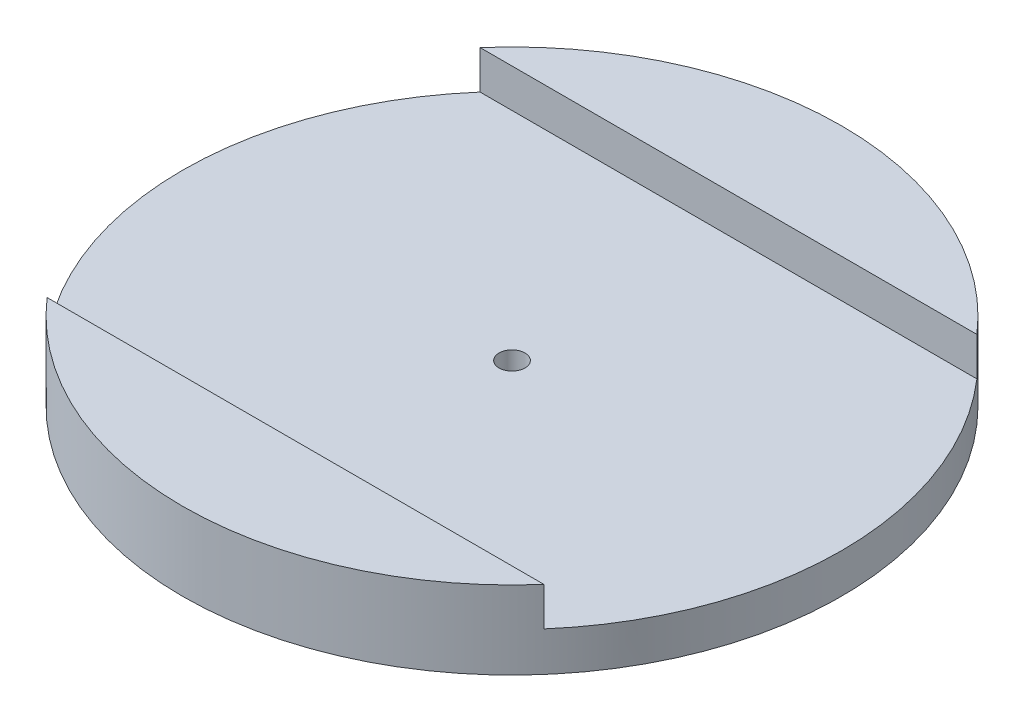
ISO-10303-21;
HEADER;
FILE_DESCRIPTION(('STEP AP214'),'2;1');
FILE_NAME('part.step','',(''),(''),'','','');
FILE_SCHEMA(('AUTOMOTIVE_DESIGN { 1 0 10303 214 1 1 1 1 }'));
ENDSEC;
DATA;
#1=APPLICATION_CONTEXT('core data for automotive mechanical design processes');
#2=APPLICATION_PROTOCOL_DEFINITION('international standard','automotive_design',2000,#1);
#3=PRODUCT_CONTEXT('',#1,'mechanical');
#4=PRODUCT('Part','Part','',(#3));
#5=PRODUCT_RELATED_PRODUCT_CATEGORY('part','',(#4));
#6=PRODUCT_DEFINITION_FORMATION('','',#4);
#7=PRODUCT_DEFINITION_CONTEXT('part definition',#1,'design');
#8=PRODUCT_DEFINITION('design','',#6,#7);
#9=PRODUCT_DEFINITION_SHAPE('','',#8);
#10=(LENGTH_UNIT() NAMED_UNIT(*) SI_UNIT(.MILLI.,.METRE.));
#11=(NAMED_UNIT(*) PLANE_ANGLE_UNIT() SI_UNIT($,.RADIAN.));
#12=(NAMED_UNIT(*) SI_UNIT($,.STERADIAN.) SOLID_ANGLE_UNIT());
#13=UNCERTAINTY_MEASURE_WITH_UNIT(LENGTH_MEASURE(1.E-05),#10,'distance_accuracy_value','');
#14=(GEOMETRIC_REPRESENTATION_CONTEXT(3) GLOBAL_UNCERTAINTY_ASSIGNED_CONTEXT((#13)) GLOBAL_UNIT_ASSIGNED_CONTEXT((#10,
#11,#12)) REPRESENTATION_CONTEXT('',''));
#15=CARTESIAN_POINT('',(0.,0.,0.));
#16=DIRECTION('',(0.,0.,1.));
#17=DIRECTION('',(1.,0.,0.));
#18=AXIS2_PLACEMENT_3D('',#15,#16,#17);
#19=CARTESIAN_POINT('',(0.,18.,0.));
#20=DIRECTION('',(0.,1.,0.));
#21=DIRECTION('',(0.,0.,1.));
#22=AXIS2_PLACEMENT_3D('',#19,#20,#21);
#23=PLANE('',#22);
#24=DIRECTION('',(-1.,0.,0.));
#25=VECTOR('',#24,1.);
#26=CARTESIAN_POINT('',(0.,18.,-49.9317963849467));
#27=LINE('',#26,#25);
#28=CARTESIAN_POINT('',(57.2958611923429,18.,-49.9317963849467));
#29=VERTEX_POINT('',#28);
#30=CARTESIAN_POINT('',(-57.2958611923429,18.,-49.9317963849467));
#31=VERTEX_POINT('',#30);
#32=EDGE_CURVE('E86',#29,#31,#27,.T.);
#33=ORIENTED_EDGE('',*,*,#32,.F.);
#34=CARTESIAN_POINT('',(0.,18.,0.));
#35=DIRECTION('',(0.,1.,0.));
#36=DIRECTION('',(0.,0.,1.));
#37=AXIS2_PLACEMENT_3D('',#34,#35,#36);
#38=CIRCLE('',#37,76.);
#39=EDGE_CURVE('E87',#29,#31,#38,.T.);
#40=ORIENTED_EDGE('',*,*,#39,.T.);
#41=EDGE_LOOP('',(#33,#40));
#42=FACE_BOUND('',#41,.T.);
#43=ADVANCED_FACE('F39',(#42),#23,.T.);
#44=CARTESIAN_POINT('',(0.,18.,0.));
#45=DIRECTION('',(0.,-1.,0.));
#46=DIRECTION('',(0.,0.,-1.));
#47=AXIS2_PLACEMENT_3D('',#44,#45,#46);
#48=CYLINDRICAL_SURFACE('',#47,76.);
#49=ORIENTED_EDGE('',*,*,#39,.F.);
#50=DIRECTION('',(0.,-1.,0.));
#51=VECTOR('',#50,1.);
#52=CARTESIAN_POINT('',(57.2958611923429,18.,-49.9317963849467));
#53=LINE('',#52,#51);
#54=CARTESIAN_POINT('',(57.2958611923429,9.11,-49.9317963849467));
#55=VERTEX_POINT('',#54);
#56=EDGE_CURVE('E102',#29,#55,#53,.T.);
#57=ORIENTED_EDGE('',*,*,#56,.T.);
#58=CARTESIAN_POINT('',(0.,9.11,0.));
#59=DIRECTION('',(0.,1.,0.));
#60=DIRECTION('',(0.,0.,1.));
#61=AXIS2_PLACEMENT_3D('',#58,#59,#60);
#62=CIRCLE('',#61,76.);
#63=CARTESIAN_POINT('',(57.2958611923429,9.11,49.9317963849467));
#64=VERTEX_POINT('',#63);
#65=EDGE_CURVE('E11',#64,#55,#62,.T.);
#66=ORIENTED_EDGE('',*,*,#65,.F.);
#67=DIRECTION('',(0.,-1.,0.));
#68=VECTOR('',#67,1.);
#69=CARTESIAN_POINT('',(57.2958611923429,18.,49.9317963849467));
#70=LINE('',#69,#68);
#71=CARTESIAN_POINT('',(57.2958611923429,18.,49.9317963849467));
#72=VERTEX_POINT('',#71);
#73=EDGE_CURVE('E81',#64,#72,#70,.F.);
#74=ORIENTED_EDGE('',*,*,#73,.T.);
#75=CARTESIAN_POINT('',(-57.2958611923429,18.,49.9317963849467));
#76=VERTEX_POINT('',#75);
#77=EDGE_CURVE('E93',#76,#72,#38,.T.);
#78=ORIENTED_EDGE('',*,*,#77,.F.);
#79=DIRECTION('',(0.,-1.,0.));
#80=VECTOR('',#79,1.);
#81=CARTESIAN_POINT('',(-57.2958611923429,18.,49.9317963849467));
#82=LINE('',#81,#80);
#83=CARTESIAN_POINT('',(-57.2958611923429,9.11,49.9317963849467));
#84=VERTEX_POINT('',#83);
#85=EDGE_CURVE('E54',#76,#84,#82,.T.);
#86=ORIENTED_EDGE('',*,*,#85,.T.);
#87=CARTESIAN_POINT('',(-57.2958611923429,9.11,-49.9317963849467));
#88=VERTEX_POINT('',#87);
#89=EDGE_CURVE('E43',#88,#84,#62,.T.);
#90=ORIENTED_EDGE('',*,*,#89,.F.);
#91=DIRECTION('',(0.,-1.,0.));
#92=VECTOR('',#91,1.);
#93=CARTESIAN_POINT('',(-57.2958611923429,18.,-49.9317963849467));
#94=LINE('',#93,#92);
#95=EDGE_CURVE('E62',#88,#31,#94,.F.);
#96=ORIENTED_EDGE('',*,*,#95,.T.);
#97=EDGE_LOOP('',(#49,#57,#66,#74,#78,#86,#90,#96));
#98=FACE_BOUND('',#97,.T.);
#99=CARTESIAN_POINT('',(0.,0.,0.));
#100=DIRECTION('',(0.,1.,0.));
#101=DIRECTION('',(0.,0.,1.));
#102=AXIS2_PLACEMENT_3D('',#99,#100,#101);
#103=CIRCLE('',#102,76.);
#104=CARTESIAN_POINT('',(0.,0.,76.));
#105=VERTEX_POINT('',#104);
#106=EDGE_CURVE('E98',#105,#105,#103,.T.);
#107=ORIENTED_EDGE('',*,*,#106,.T.);
#108=EDGE_LOOP('',(#107));
#109=FACE_BOUND('',#108,.T.);
#110=ADVANCED_FACE('F41',(#98,#109),#48,.T.);
#111=DIRECTION('',(1.,0.,0.));
#112=VECTOR('',#111,1.);
#113=CARTESIAN_POINT('',(0.,18.,49.9317963849467));
#114=LINE('',#113,#112);
#115=EDGE_CURVE('E78',#76,#72,#114,.T.);
#116=ORIENTED_EDGE('',*,*,#115,.F.);
#117=ORIENTED_EDGE('',*,*,#77,.T.);
#118=EDGE_LOOP('',(#116,#117));
#119=FACE_BOUND('',#118,.T.);
#120=ADVANCED_FACE('F97',(#119),#23,.T.);
#121=CARTESIAN_POINT('',(0.,0.,0.));
#122=DIRECTION('',(0.,1.,0.));
#123=DIRECTION('',(0.,0.,1.));
#124=AXIS2_PLACEMENT_3D('',#121,#122,#123);
#125=PLANE('',#124);
#126=CARTESIAN_POINT('',(0.,0.,0.));
#127=DIRECTION('',(0.,1.,0.));
#128=DIRECTION('',(0.,0.,1.));
#129=AXIS2_PLACEMENT_3D('',#126,#127,#128);
#130=CIRCLE('',#129,3.);
#131=CARTESIAN_POINT('',(0.,0.,3.));
#132=VERTEX_POINT('',#131);
#133=EDGE_CURVE('E111',#132,#132,#130,.T.);
#134=ORIENTED_EDGE('',*,*,#133,.T.);
#135=EDGE_LOOP('',(#134));
#136=FACE_BOUND('',#135,.T.);
#137=ORIENTED_EDGE('',*,*,#106,.F.);
#138=EDGE_LOOP('',(#137));
#139=FACE_BOUND('',#138,.T.);
#140=ADVANCED_FACE('F127',(#136,#139),#125,.F.);
#141=CARTESIAN_POINT('',(-58.0079555223723,9.11,0.));
#142=DIRECTION('',(0.,1.,0.));
#143=DIRECTION('',(0.,0.,1.));
#144=AXIS2_PLACEMENT_3D('',#141,#142,#143);
#145=PLANE('',#144);
#146=CARTESIAN_POINT('',(0.,9.11,0.));
#147=DIRECTION('',(0.,1.,0.));
#148=DIRECTION('',(0.,0.,1.));
#149=AXIS2_PLACEMENT_3D('',#146,#147,#148);
#150=CIRCLE('',#149,3.);
#151=CARTESIAN_POINT('',(0.,9.11,3.));
#152=VERTEX_POINT('',#151);
#153=EDGE_CURVE('E118',#152,#152,#150,.T.);
#154=ORIENTED_EDGE('',*,*,#153,.F.);
#155=EDGE_LOOP('',(#154));
#156=FACE_BOUND('',#155,.T.);
#157=ORIENTED_EDGE('',*,*,#65,.T.);
#158=DIRECTION('',(-1.,0.,0.));
#159=VECTOR('',#158,1.);
#160=CARTESIAN_POINT('',(-58.0079555223723,9.11,-49.9317963849467));
#161=LINE('',#160,#159);
#162=EDGE_CURVE('E95',#55,#88,#161,.T.);
#163=ORIENTED_EDGE('',*,*,#162,.T.);
#164=ORIENTED_EDGE('',*,*,#89,.T.);
#165=DIRECTION('',(1.,0.,0.));
#166=VECTOR('',#165,1.);
#167=CARTESIAN_POINT('',(-58.0079555223723,9.11,49.9317963849467));
#168=LINE('',#167,#166);
#169=EDGE_CURVE('E110',#84,#64,#168,.T.);
#170=ORIENTED_EDGE('',*,*,#169,.T.);
#171=EDGE_LOOP('',(#157,#163,#164,#170));
#172=FACE_BOUND('',#171,.T.);
#173=ADVANCED_FACE('F109',(#156,#172),#145,.T.);
#174=CARTESIAN_POINT('',(-58.0079555223723,9.11,-49.9317963849467));
#175=DIRECTION('',(0.,0.,-1.));
#176=DIRECTION('',(-1.,0.,0.));
#177=AXIS2_PLACEMENT_3D('',#174,#175,#176);
#178=PLANE('',#177);
#179=ORIENTED_EDGE('',*,*,#32,.T.);
#180=ORIENTED_EDGE('',*,*,#95,.F.);
#181=ORIENTED_EDGE('',*,*,#162,.F.);
#182=ORIENTED_EDGE('',*,*,#56,.F.);
#183=EDGE_LOOP('',(#179,#180,#181,#182));
#184=FACE_BOUND('',#183,.T.);
#185=ADVANCED_FACE('F126',(#184),#178,.F.);
#186=CARTESIAN_POINT('',(-58.0079555223723,9.11,49.9317963849467));
#187=DIRECTION('',(0.,0.,1.));
#188=DIRECTION('',(1.,0.,0.));
#189=AXIS2_PLACEMENT_3D('',#186,#187,#188);
#190=PLANE('',#189);
#191=ORIENTED_EDGE('',*,*,#115,.T.);
#192=ORIENTED_EDGE('',*,*,#73,.F.);
#193=ORIENTED_EDGE('',*,*,#169,.F.);
#194=ORIENTED_EDGE('',*,*,#85,.F.);
#195=EDGE_LOOP('',(#191,#192,#193,#194));
#196=FACE_BOUND('',#195,.T.);
#197=ADVANCED_FACE('F80',(#196),#190,.F.);
#198=CARTESIAN_POINT('',(0.,-10.89,0.));
#199=DIRECTION('',(0.,1.,0.));
#200=DIRECTION('',(0.,0.,1.));
#201=AXIS2_PLACEMENT_3D('',#198,#199,#200);
#202=CYLINDRICAL_SURFACE('',#201,3.);
#203=ORIENTED_EDGE('',*,*,#153,.T.);
#204=EDGE_LOOP('',(#203));
#205=FACE_BOUND('',#204,.T.);
#206=ORIENTED_EDGE('',*,*,#133,.F.);
#207=EDGE_LOOP('',(#206));
#208=FACE_BOUND('',#207,.T.);
#209=ADVANCED_FACE('F122',(#205,#208),#202,.F.);
#210=CLOSED_SHELL('',(#43,#110,#120,#140,#173,#185,#197,#209));
#211=MANIFOLD_SOLID_BREP('B2',#210);
#212=ADVANCED_BREP_SHAPE_REPRESENTATION('',(#18,#211),#14);
#213=SHAPE_DEFINITION_REPRESENTATION(#9,#212);
ENDSEC;
END-ISO-10303-21;
